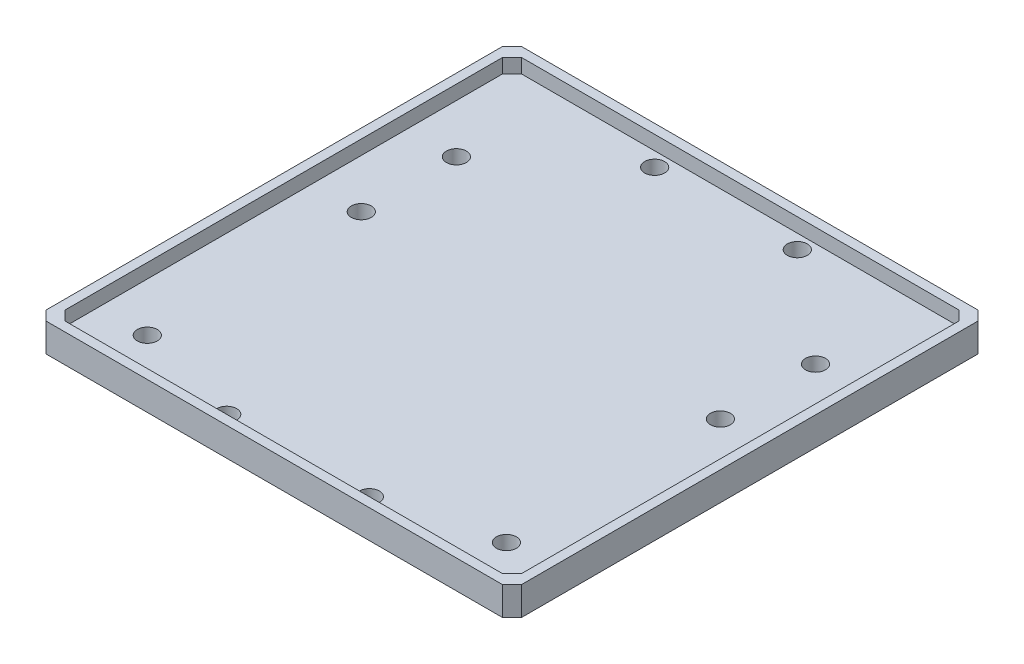
ISO-10303-21;
HEADER;
FILE_DESCRIPTION(('STEP AP214'),'2;1');
FILE_NAME('part.step','',(''),(''),'','','');
FILE_SCHEMA(('AUTOMOTIVE_DESIGN { 1 0 10303 214 1 1 1 1 }'));
ENDSEC;
DATA;
#1=APPLICATION_CONTEXT('core data for automotive mechanical design processes');
#2=APPLICATION_PROTOCOL_DEFINITION('international standard','automotive_design',2000,#1);
#3=PRODUCT_CONTEXT('',#1,'mechanical');
#4=PRODUCT('Part','Part','',(#3));
#5=PRODUCT_RELATED_PRODUCT_CATEGORY('part','',(#4));
#6=PRODUCT_DEFINITION_FORMATION('','',#4);
#7=PRODUCT_DEFINITION_CONTEXT('part definition',#1,'design');
#8=PRODUCT_DEFINITION('design','',#6,#7);
#9=PRODUCT_DEFINITION_SHAPE('','',#8);
#10=(LENGTH_UNIT() NAMED_UNIT(*) SI_UNIT(.MILLI.,.METRE.));
#11=(NAMED_UNIT(*) PLANE_ANGLE_UNIT() SI_UNIT($,.RADIAN.));
#12=(NAMED_UNIT(*) SI_UNIT($,.STERADIAN.) SOLID_ANGLE_UNIT());
#13=UNCERTAINTY_MEASURE_WITH_UNIT(LENGTH_MEASURE(1.E-05),#10,'distance_accuracy_value','');
#14=(GEOMETRIC_REPRESENTATION_CONTEXT(3) GLOBAL_UNCERTAINTY_ASSIGNED_CONTEXT((#13)) GLOBAL_UNIT_ASSIGNED_CONTEXT((#10,
#11,#12)) REPRESENTATION_CONTEXT('',''));
#15=CARTESIAN_POINT('',(0.,0.,0.));
#16=DIRECTION('',(0.,0.,1.));
#17=DIRECTION('',(1.,0.,0.));
#18=AXIS2_PLACEMENT_3D('',#15,#16,#17);
#19=CARTESIAN_POINT('',(0.,3.,0.));
#20=DIRECTION('',(0.,1.,0.));
#21=DIRECTION('',(0.,0.,1.));
#22=AXIS2_PLACEMENT_3D('',#19,#20,#21);
#23=PLANE('',#22);
#24=CARTESIAN_POINT('',(77.2035074999913,3.,87.3604147454228));
#25=DIRECTION('',(0.,1.,0.));
#26=DIRECTION('',(0.,0.,-1.));
#27=AXIS2_PLACEMENT_3D('',#24,#25,#26);
#28=CIRCLE('',#27,2.09999999999997);
#29=CARTESIAN_POINT('',(77.2035074999913,3.,85.2604147454228));
#30=VERTEX_POINT('',#29);
#31=EDGE_CURVE('E201',#30,#30,#28,.T.);
#32=ORIENTED_EDGE('',*,*,#31,.F.);
#33=EDGE_LOOP('',(#32));
#34=FACE_BOUND('',#33,.T.);
#35=CARTESIAN_POINT('',(77.2035074999913,3.,152.360414745423));
#36=DIRECTION('',(0.,1.,0.));
#37=DIRECTION('',(0.,0.,-1.));
#38=AXIS2_PLACEMENT_3D('',#35,#36,#37);
#39=CIRCLE('',#38,2.09999999999999);
#40=CARTESIAN_POINT('',(77.2035074999913,3.,150.260414745423));
#41=VERTEX_POINT('',#40);
#42=EDGE_CURVE('E213',#41,#41,#39,.T.);
#43=ORIENTED_EDGE('',*,*,#42,.F.);
#44=EDGE_LOOP('',(#43));
#45=FACE_BOUND('',#44,.T.);
#46=CARTESIAN_POINT('',(24.4441539849667,3.,68.4248216350618));
#47=DIRECTION('',(0.,1.,0.));
#48=DIRECTION('',(0.,0.,1.));
#49=AXIS2_PLACEMENT_3D('',#46,#47,#48);
#50=CIRCLE('',#49,2.1);
#51=CARTESIAN_POINT('',(24.4441539849667,3.,70.5248216350618));
#52=VERTEX_POINT('',#51);
#53=EDGE_CURVE('E225',#52,#52,#50,.T.);
#54=ORIENTED_EDGE('',*,*,#53,.F.);
#55=EDGE_LOOP('',(#54));
#56=FACE_BOUND('',#55,.T.);
#57=CARTESIAN_POINT('',(1.68480046994186,3.,152.360414745423));
#58=DIRECTION('',(0.,1.,0.));
#59=DIRECTION('',(0.,0.,1.));
#60=AXIS2_PLACEMENT_3D('',#57,#58,#59);
#61=CIRCLE('',#60,2.1);
#62=CARTESIAN_POINT('',(1.68480046994186,3.,154.460414745423));
#63=VERTEX_POINT('',#62);
#64=EDGE_CURVE('E237',#63,#63,#61,.T.);
#65=ORIENTED_EDGE('',*,*,#64,.F.);
#66=EDGE_LOOP('',(#65));
#67=FACE_BOUND('',#66,.T.);
#68=CARTESIAN_POINT('',(1.68480046994187,3.,87.3604147454228));
#69=DIRECTION('',(0.,1.,0.));
#70=DIRECTION('',(0.,0.,1.));
#71=AXIS2_PLACEMENT_3D('',#68,#69,#70);
#72=CIRCLE('',#71,2.09999999999998);
#73=CARTESIAN_POINT('',(1.68480046994187,3.,89.4604147454228));
#74=VERTEX_POINT('',#73);
#75=EDGE_CURVE('E249',#74,#74,#72,.T.);
#76=ORIENTED_EDGE('',*,*,#75,.F.);
#77=EDGE_LOOP('',(#76));
#78=FACE_BOUND('',#77,.T.);
#79=CARTESIAN_POINT('',(1.68480046994187,3.,107.360414745423));
#80=DIRECTION('',(0.,1.,0.));
#81=DIRECTION('',(0.,0.,1.));
#82=AXIS2_PLACEMENT_3D('',#79,#80,#81);
#83=CIRCLE('',#82,2.10000000000001);
#84=CARTESIAN_POINT('',(1.68480046994187,3.,109.460414745423));
#85=VERTEX_POINT('',#84);
#86=EDGE_CURVE('E243',#85,#85,#83,.T.);
#87=ORIENTED_EDGE('',*,*,#86,.F.);
#88=EDGE_LOOP('',(#87));
#89=FACE_BOUND('',#88,.T.);
#90=CARTESIAN_POINT('',(24.4441539849667,3.,158.424821635062));
#91=DIRECTION('',(0.,1.,0.));
#92=DIRECTION('',(0.,0.,1.));
#93=AXIS2_PLACEMENT_3D('',#90,#91,#92);
#94=CIRCLE('',#93,2.09999999999999);
#95=CARTESIAN_POINT('',(24.4441539849667,3.,160.524821635062));
#96=VERTEX_POINT('',#95);
#97=EDGE_CURVE('E231',#96,#96,#94,.T.);
#98=ORIENTED_EDGE('',*,*,#97,.F.);
#99=EDGE_LOOP('',(#98));
#100=FACE_BOUND('',#99,.T.);
#101=CARTESIAN_POINT('',(54.4441539849665,3.,158.424821635062));
#102=DIRECTION('',(0.,1.,0.));
#103=DIRECTION('',(0.,0.,-1.));
#104=AXIS2_PLACEMENT_3D('',#101,#102,#103);
#105=CIRCLE('',#104,2.09999999999999);
#106=CARTESIAN_POINT('',(54.4441539849665,3.,156.324821635062));
#107=VERTEX_POINT('',#106);
#108=EDGE_CURVE('E219',#107,#107,#105,.T.);
#109=ORIENTED_EDGE('',*,*,#108,.F.);
#110=EDGE_LOOP('',(#109));
#111=FACE_BOUND('',#110,.T.);
#112=CARTESIAN_POINT('',(77.2035074999913,3.,107.360414745423));
#113=DIRECTION('',(0.,1.,0.));
#114=DIRECTION('',(0.,0.,-1.));
#115=AXIS2_PLACEMENT_3D('',#112,#113,#114);
#116=CIRCLE('',#115,2.10000000000002);
#117=CARTESIAN_POINT('',(77.2035074999913,3.,105.260414745423));
#118=VERTEX_POINT('',#117);
#119=EDGE_CURVE('E207',#118,#118,#116,.T.);
#120=ORIENTED_EDGE('',*,*,#119,.F.);
#121=EDGE_LOOP('',(#120));
#122=FACE_BOUND('',#121,.T.);
#123=CARTESIAN_POINT('',(54.4441539849665,3.,68.4248216350618));
#124=DIRECTION('',(0.,1.,0.));
#125=DIRECTION('',(0.,0.,-1.));
#126=AXIS2_PLACEMENT_3D('',#123,#124,#125);
#127=CIRCLE('',#126,2.1);
#128=CARTESIAN_POINT('',(54.4441539849665,3.,66.3248216350618));
#129=VERTEX_POINT('',#128);
#130=EDGE_CURVE('E193',#129,#129,#127,.T.);
#131=ORIENTED_EDGE('',*,*,#130,.F.);
#132=EDGE_LOOP('',(#131));
#133=FACE_BOUND('',#132,.T.);
#134=DIRECTION('',(0.,0.,-1.));
#135=VECTOR('',#134,1.);
#136=CARTESIAN_POINT('',(-8.55584601503339,3.,163.424821635062));
#137=LINE('',#136,#135);
#138=CARTESIAN_POINT('',(-8.55584601503339,3.,159.424821635062));
#139=VERTEX_POINT('',#138);
#140=CARTESIAN_POINT('',(-8.55584601503339,3.,67.4248216350618));
#141=VERTEX_POINT('',#140);
#142=EDGE_CURVE('E180',#139,#141,#137,.T.);
#143=ORIENTED_EDGE('',*,*,#142,.F.);
#144=DIRECTION('',(-0.707106781186547,0.,-0.707106781186548));
#145=VECTOR('',#144,1.);
#146=CARTESIAN_POINT('',(-6.55584601503339,3.,161.424821635062));
#147=LINE('',#146,#145);
#148=CARTESIAN_POINT('',(-6.55584601503339,3.,161.424821635062));
#149=VERTEX_POINT('',#148);
#150=EDGE_CURVE('E165',#149,#139,#147,.T.);
#151=ORIENTED_EDGE('',*,*,#150,.F.);
#152=DIRECTION('',(-1.,0.,0.));
#153=VECTOR('',#152,1.);
#154=CARTESIAN_POINT('',(-8.55584601503339,3.,161.424821635062));
#155=LINE('',#154,#153);
#156=CARTESIAN_POINT('',(85.4441539849666,3.,161.424821635062));
#157=VERTEX_POINT('',#156);
#158=EDGE_CURVE('E483',#157,#149,#155,.T.);
#159=ORIENTED_EDGE('',*,*,#158,.F.);
#160=DIRECTION('',(-0.707106781186545,0.,0.70710678118655));
#161=VECTOR('',#160,1.);
#162=CARTESIAN_POINT('',(85.4441539849666,3.,161.424821635062));
#163=LINE('',#162,#161);
#164=CARTESIAN_POINT('',(87.4441539849666,3.,159.424821635062));
#165=VERTEX_POINT('',#164);
#166=EDGE_CURVE('E173',#165,#157,#163,.T.);
#167=ORIENTED_EDGE('',*,*,#166,.F.);
#168=DIRECTION('',(0.,0.,-1.));
#169=VECTOR('',#168,1.);
#170=CARTESIAN_POINT('',(87.4441539849667,3.,0.));
#171=LINE('',#170,#169);
#172=CARTESIAN_POINT('',(87.4441539849666,3.,67.4248216350618));
#173=VERTEX_POINT('',#172);
#174=EDGE_CURVE('E187',#165,#173,#171,.T.);
#175=ORIENTED_EDGE('',*,*,#174,.T.);
#176=DIRECTION('',(0.707106781186545,0.,0.70710678118655));
#177=VECTOR('',#176,1.);
#178=CARTESIAN_POINT('',(85.4441539849666,3.,65.4248216350618));
#179=LINE('',#178,#177);
#180=CARTESIAN_POINT('',(85.4441539849666,3.,65.4248216350618));
#181=VERTEX_POINT('',#180);
#182=EDGE_CURVE('E500',#181,#173,#179,.T.);
#183=ORIENTED_EDGE('',*,*,#182,.F.);
#184=DIRECTION('',(1.,0.,0.));
#185=VECTOR('',#184,1.);
#186=CARTESIAN_POINT('',(0.,3.,65.4248216350618));
#187=LINE('',#186,#185);
#188=CARTESIAN_POINT('',(-6.55584601503339,3.,65.4248216350618));
#189=VERTEX_POINT('',#188);
#190=EDGE_CURVE('E191',#189,#181,#187,.T.);
#191=ORIENTED_EDGE('',*,*,#190,.F.);
#192=DIRECTION('',(0.707106781186547,0.,-0.707106781186548));
#193=VECTOR('',#192,1.);
#194=CARTESIAN_POINT('',(-6.55584601503339,3.,65.4248216350618));
#195=LINE('',#194,#193);
#196=EDGE_CURVE('E481',#141,#189,#195,.T.);
#197=ORIENTED_EDGE('',*,*,#196,.F.);
#198=EDGE_LOOP('',(#143,#151,#159,#167,#175,#183,#191,#197));
#199=FACE_BOUND('',#198,.T.);
#200=ADVANCED_FACE('F40',(#34,#45,#56,#67,#78,#89,#100,#111,#122,#133,#199),#23,.T.);
#201=CARTESIAN_POINT('',(-8.55584601503339,6.,161.424821635062));
#202=DIRECTION('',(0.,0.,1.));
#203=DIRECTION('',(1.,0.,0.));
#204=AXIS2_PLACEMENT_3D('',#201,#202,#203);
#205=PLANE('',#204);
#206=DIRECTION('',(0.,-1.,0.));
#207=VECTOR('',#206,1.);
#208=CARTESIAN_POINT('',(-6.55584601503339,6.,161.424821635062));
#209=LINE('',#208,#207);
#210=CARTESIAN_POINT('',(-6.55584601503339,6.,161.424821635062));
#211=VERTEX_POINT('',#210);
#212=EDGE_CURVE('E164',#211,#149,#209,.T.);
#213=ORIENTED_EDGE('',*,*,#212,.F.);
#214=DIRECTION('',(-1.,0.,0.));
#215=VECTOR('',#214,1.);
#216=CARTESIAN_POINT('',(-8.55584601503339,6.,161.424821635062));
#217=LINE('',#216,#215);
#218=CARTESIAN_POINT('',(85.4441539849666,6.,161.424821635062));
#219=VERTEX_POINT('',#218);
#220=EDGE_CURVE('E161',#219,#211,#217,.T.);
#221=ORIENTED_EDGE('',*,*,#220,.F.);
#222=DIRECTION('',(0.,-1.,0.));
#223=VECTOR('',#222,1.);
#224=CARTESIAN_POINT('',(85.4441539849666,6.,161.424821635062));
#225=LINE('',#224,#223);
#226=EDGE_CURVE('E56',#219,#157,#225,.T.);
#227=ORIENTED_EDGE('',*,*,#226,.T.);
#228=ORIENTED_EDGE('',*,*,#158,.T.);
#229=EDGE_LOOP('',(#213,#221,#227,#228));
#230=FACE_BOUND('',#229,.T.);
#231=ADVANCED_FACE('F348',(#230),#205,.F.);
#232=CARTESIAN_POINT('',(-8.55584601503339,6.,163.424821635062));
#233=DIRECTION('',(-1.,0.,0.));
#234=DIRECTION('',(0.,0.,1.));
#235=AXIS2_PLACEMENT_3D('',#232,#233,#234);
#236=PLANE('',#235);
#237=DIRECTION('',(0.,-1.,0.));
#238=VECTOR('',#237,1.);
#239=CARTESIAN_POINT('',(-8.55584601503339,6.,159.424821635062));
#240=LINE('',#239,#238);
#241=CARTESIAN_POINT('',(-8.55584601503339,6.,159.424821635062));
#242=VERTEX_POINT('',#241);
#243=EDGE_CURVE('E168',#242,#139,#240,.T.);
#244=ORIENTED_EDGE('',*,*,#243,.T.);
#245=ORIENTED_EDGE('',*,*,#142,.T.);
#246=DIRECTION('',(0.,-1.,0.));
#247=VECTOR('',#246,1.);
#248=CARTESIAN_POINT('',(-8.55584601503339,6.,67.4248216350618));
#249=LINE('',#248,#247);
#250=CARTESIAN_POINT('',(-8.55584601503339,6.,67.4248216350618));
#251=VERTEX_POINT('',#250);
#252=EDGE_CURVE('E178',#251,#141,#249,.T.);
#253=ORIENTED_EDGE('',*,*,#252,.F.);
#254=DIRECTION('',(0.,0.,-1.));
#255=VECTOR('',#254,1.);
#256=CARTESIAN_POINT('',(-8.55584601503339,6.,163.424821635062));
#257=LINE('',#256,#255);
#258=EDGE_CURVE('E159',#242,#251,#257,.T.);
#259=ORIENTED_EDGE('',*,*,#258,.F.);
#260=EDGE_LOOP('',(#244,#245,#253,#259));
#261=FACE_BOUND('',#260,.T.);
#262=ADVANCED_FACE('F176',(#261),#236,.F.);
#263=CARTESIAN_POINT('',(87.4441539849667,6.,0.));
#264=DIRECTION('',(-1.,0.,0.));
#265=DIRECTION('',(0.,0.,1.));
#266=AXIS2_PLACEMENT_3D('',#263,#264,#265);
#267=PLANE('',#266);
#268=ORIENTED_EDGE('',*,*,#174,.F.);
#269=DIRECTION('',(0.,-1.,0.));
#270=VECTOR('',#269,1.);
#271=CARTESIAN_POINT('',(87.4441539849666,6.,159.424821635062));
#272=LINE('',#271,#270);
#273=CARTESIAN_POINT('',(87.4441539849666,6.,159.424821635062));
#274=VERTEX_POINT('',#273);
#275=EDGE_CURVE('E509',#274,#165,#272,.T.);
#276=ORIENTED_EDGE('',*,*,#275,.F.);
#277=DIRECTION('',(0.,0.,-1.));
#278=VECTOR('',#277,1.);
#279=CARTESIAN_POINT('',(87.4441539849667,6.,0.));
#280=LINE('',#279,#278);
#281=CARTESIAN_POINT('',(87.4441539849666,6.,67.4248216350618));
#282=VERTEX_POINT('',#281);
#283=EDGE_CURVE('E308',#274,#282,#280,.T.);
#284=ORIENTED_EDGE('',*,*,#283,.T.);
#285=DIRECTION('',(0.,-1.,0.));
#286=VECTOR('',#285,1.);
#287=CARTESIAN_POINT('',(87.4441539849666,6.,67.4248216350618));
#288=LINE('',#287,#286);
#289=EDGE_CURVE('E506',#282,#173,#288,.T.);
#290=ORIENTED_EDGE('',*,*,#289,.T.);
#291=EDGE_LOOP('',(#268,#276,#284,#290));
#292=FACE_BOUND('',#291,.T.);
#293=ADVANCED_FACE('F397',(#292),#267,.T.);
#294=CARTESIAN_POINT('',(0.,6.,65.4248216350618));
#295=DIRECTION('',(0.,0.,-1.));
#296=DIRECTION('',(-1.,0.,0.));
#297=AXIS2_PLACEMENT_3D('',#294,#295,#296);
#298=PLANE('',#297);
#299=DIRECTION('',(0.,-1.,0.));
#300=VECTOR('',#299,1.);
#301=CARTESIAN_POINT('',(85.4441539849666,6.,65.4248216350618));
#302=LINE('',#301,#300);
#303=CARTESIAN_POINT('',(85.4441539849666,6.,65.4248216350618));
#304=VERTEX_POINT('',#303);
#305=EDGE_CURVE('E507',#304,#181,#302,.T.);
#306=ORIENTED_EDGE('',*,*,#305,.F.);
#307=DIRECTION('',(1.,0.,0.));
#308=VECTOR('',#307,1.);
#309=CARTESIAN_POINT('',(0.,6.,65.4248216350618));
#310=LINE('',#309,#308);
#311=CARTESIAN_POINT('',(-6.55584601503339,6.,65.4248216350618));
#312=VERTEX_POINT('',#311);
#313=EDGE_CURVE('E491',#312,#304,#310,.T.);
#314=ORIENTED_EDGE('',*,*,#313,.F.);
#315=DIRECTION('',(0.,-1.,0.));
#316=VECTOR('',#315,1.);
#317=CARTESIAN_POINT('',(-6.55584601503339,6.,65.4248216350618));
#318=LINE('',#317,#316);
#319=EDGE_CURVE('E64',#312,#189,#318,.T.);
#320=ORIENTED_EDGE('',*,*,#319,.T.);
#321=ORIENTED_EDGE('',*,*,#190,.T.);
#322=EDGE_LOOP('',(#306,#314,#320,#321));
#323=FACE_BOUND('',#322,.T.);
#324=ADVANCED_FACE('F364',(#323),#298,.F.);
#325=CARTESIAN_POINT('',(0.,0.,0.));
#326=DIRECTION('',(0.,1.,0.));
#327=DIRECTION('',(0.,0.,1.));
#328=AXIS2_PLACEMENT_3D('',#325,#326,#327);
#329=PLANE('',#328);
#330=DIRECTION('',(0.,0.,1.));
#331=VECTOR('',#330,1.);
#332=CARTESIAN_POINT('',(-10.5558460150334,0.,63.4248216350618));
#333=LINE('',#332,#331);
#334=CARTESIAN_POINT('',(-10.5558460150334,0.,65.4248216350618));
#335=VERTEX_POINT('',#334);
#336=CARTESIAN_POINT('',(-10.5558460150334,0.,161.424821635062));
#337=VERTEX_POINT('',#336);
#338=EDGE_CURVE('E252',#335,#337,#333,.T.);
#339=ORIENTED_EDGE('',*,*,#338,.F.);
#340=DIRECTION('',(-0.70710678118655,0.,0.707106781186545));
#341=VECTOR('',#340,1.);
#342=CARTESIAN_POINT('',(-10.5558460150334,0.,65.4248216350618));
#343=LINE('',#342,#341);
#344=CARTESIAN_POINT('',(-8.55584601503337,0.,63.4248216350618));
#345=VERTEX_POINT('',#344);
#346=EDGE_CURVE('E277',#335,#345,#343,.F.);
#347=ORIENTED_EDGE('',*,*,#346,.T.);
#348=DIRECTION('',(-1.,0.,0.));
#349=VECTOR('',#348,1.);
#350=CARTESIAN_POINT('',(-10.5558460150334,0.,63.4248216350618));
#351=LINE('',#350,#349);
#352=CARTESIAN_POINT('',(87.4441539849666,0.,63.4248216350618));
#353=VERTEX_POINT('',#352);
#354=EDGE_CURVE('E263',#353,#345,#351,.T.);
#355=ORIENTED_EDGE('',*,*,#354,.F.);
#356=DIRECTION('',(-0.707106781186545,0.,-0.70710678118655));
#357=VECTOR('',#356,1.);
#358=CARTESIAN_POINT('',(87.4441539849666,0.,63.4248216350618));
#359=LINE('',#358,#357);
#360=CARTESIAN_POINT('',(89.4441539849666,0.,65.4248216350618));
#361=VERTEX_POINT('',#360);
#362=EDGE_CURVE('E271',#353,#361,#359,.F.);
#363=ORIENTED_EDGE('',*,*,#362,.T.);
#364=DIRECTION('',(0.,0.,-1.));
#365=VECTOR('',#364,1.);
#366=CARTESIAN_POINT('',(89.4441539849666,0.,63.4248216350618));
#367=LINE('',#366,#365);
#368=CARTESIAN_POINT('',(89.4441539849666,0.,161.424821635062));
#369=VERTEX_POINT('',#368);
#370=EDGE_CURVE('E260',#369,#361,#367,.T.);
#371=ORIENTED_EDGE('',*,*,#370,.F.);
#372=DIRECTION('',(0.70710678118655,0.,-0.707106781186545));
#373=VECTOR('',#372,1.);
#374=CARTESIAN_POINT('',(89.4441539849666,0.,161.424821635062));
#375=LINE('',#374,#373);
#376=CARTESIAN_POINT('',(87.4441539849666,0.,163.424821635062));
#377=VERTEX_POINT('',#376);
#378=EDGE_CURVE('E273',#369,#377,#375,.F.);
#379=ORIENTED_EDGE('',*,*,#378,.T.);
#380=DIRECTION('',(1.,0.,0.));
#381=VECTOR('',#380,1.);
#382=CARTESIAN_POINT('',(-10.5558460150334,0.,163.424821635062));
#383=LINE('',#382,#381);
#384=CARTESIAN_POINT('',(-8.55584601503338,0.,163.424821635062));
#385=VERTEX_POINT('',#384);
#386=EDGE_CURVE('E257',#385,#377,#383,.T.);
#387=ORIENTED_EDGE('',*,*,#386,.F.);
#388=DIRECTION('',(0.707106781186543,0.,0.707106781186552));
#389=VECTOR('',#388,1.);
#390=CARTESIAN_POINT('',(-8.55584601503338,0.,163.424821635062));
#391=LINE('',#390,#389);
#392=EDGE_CURVE('E275',#385,#337,#391,.F.);
#393=ORIENTED_EDGE('',*,*,#392,.T.);
#394=EDGE_LOOP('',(#339,#347,#355,#363,#371,#379,#387,#393));
#395=FACE_BOUND('',#394,.T.);
#396=CARTESIAN_POINT('',(1.68480046994187,0.,87.3604147454228));
#397=DIRECTION('',(0.,1.,0.));
#398=DIRECTION('',(0.,0.,1.));
#399=AXIS2_PLACEMENT_3D('',#396,#397,#398);
#400=CIRCLE('',#399,2.09999999999998);
#401=CARTESIAN_POINT('',(1.68480046994187,0.,89.4604147454228));
#402=VERTEX_POINT('',#401);
#403=EDGE_CURVE('E246',#402,#402,#400,.T.);
#404=ORIENTED_EDGE('',*,*,#403,.T.);
#405=EDGE_LOOP('',(#404));
#406=FACE_BOUND('',#405,.T.);
#407=CARTESIAN_POINT('',(1.68480046994187,0.,107.360414745423));
#408=DIRECTION('',(0.,1.,0.));
#409=DIRECTION('',(0.,0.,1.));
#410=AXIS2_PLACEMENT_3D('',#407,#408,#409);
#411=CIRCLE('',#410,2.10000000000001);
#412=CARTESIAN_POINT('',(1.68480046994187,0.,109.460414745423));
#413=VERTEX_POINT('',#412);
#414=EDGE_CURVE('E240',#413,#413,#411,.T.);
#415=ORIENTED_EDGE('',*,*,#414,.T.);
#416=EDGE_LOOP('',(#415));
#417=FACE_BOUND('',#416,.T.);
#418=CARTESIAN_POINT('',(1.68480046994186,0.,152.360414745423));
#419=DIRECTION('',(0.,1.,0.));
#420=DIRECTION('',(0.,0.,1.));
#421=AXIS2_PLACEMENT_3D('',#418,#419,#420);
#422=CIRCLE('',#421,2.1);
#423=CARTESIAN_POINT('',(1.68480046994186,0.,154.460414745423));
#424=VERTEX_POINT('',#423);
#425=EDGE_CURVE('E234',#424,#424,#422,.T.);
#426=ORIENTED_EDGE('',*,*,#425,.T.);
#427=EDGE_LOOP('',(#426));
#428=FACE_BOUND('',#427,.T.);
#429=CARTESIAN_POINT('',(24.4441539849667,0.,158.424821635062));
#430=DIRECTION('',(0.,1.,0.));
#431=DIRECTION('',(0.,0.,1.));
#432=AXIS2_PLACEMENT_3D('',#429,#430,#431);
#433=CIRCLE('',#432,2.09999999999999);
#434=CARTESIAN_POINT('',(24.4441539849667,0.,160.524821635062));
#435=VERTEX_POINT('',#434);
#436=EDGE_CURVE('E228',#435,#435,#433,.T.);
#437=ORIENTED_EDGE('',*,*,#436,.T.);
#438=EDGE_LOOP('',(#437));
#439=FACE_BOUND('',#438,.T.);
#440=CARTESIAN_POINT('',(24.4441539849667,0.,68.4248216350618));
#441=DIRECTION('',(0.,1.,0.));
#442=DIRECTION('',(0.,0.,1.));
#443=AXIS2_PLACEMENT_3D('',#440,#441,#442);
#444=CIRCLE('',#443,2.1);
#445=CARTESIAN_POINT('',(24.4441539849667,0.,70.5248216350618));
#446=VERTEX_POINT('',#445);
#447=EDGE_CURVE('E222',#446,#446,#444,.T.);
#448=ORIENTED_EDGE('',*,*,#447,.T.);
#449=EDGE_LOOP('',(#448));
#450=FACE_BOUND('',#449,.T.);
#451=CARTESIAN_POINT('',(54.4441539849665,0.,158.424821635062));
#452=DIRECTION('',(0.,1.,0.));
#453=DIRECTION('',(0.,0.,-1.));
#454=AXIS2_PLACEMENT_3D('',#451,#452,#453);
#455=CIRCLE('',#454,2.09999999999999);
#456=CARTESIAN_POINT('',(54.4441539849665,0.,156.324821635062));
#457=VERTEX_POINT('',#456);
#458=EDGE_CURVE('E216',#457,#457,#455,.T.);
#459=ORIENTED_EDGE('',*,*,#458,.T.);
#460=EDGE_LOOP('',(#459));
#461=FACE_BOUND('',#460,.T.);
#462=CARTESIAN_POINT('',(77.2035074999913,0.,152.360414745423));
#463=DIRECTION('',(0.,1.,0.));
#464=DIRECTION('',(0.,0.,-1.));
#465=AXIS2_PLACEMENT_3D('',#462,#463,#464);
#466=CIRCLE('',#465,2.09999999999999);
#467=CARTESIAN_POINT('',(77.2035074999913,0.,150.260414745423));
#468=VERTEX_POINT('',#467);
#469=EDGE_CURVE('E210',#468,#468,#466,.T.);
#470=ORIENTED_EDGE('',*,*,#469,.T.);
#471=EDGE_LOOP('',(#470));
#472=FACE_BOUND('',#471,.T.);
#473=CARTESIAN_POINT('',(77.2035074999913,0.,107.360414745423));
#474=DIRECTION('',(0.,1.,0.));
#475=DIRECTION('',(0.,0.,-1.));
#476=AXIS2_PLACEMENT_3D('',#473,#474,#475);
#477=CIRCLE('',#476,2.10000000000002);
#478=CARTESIAN_POINT('',(77.2035074999913,0.,105.260414745423));
#479=VERTEX_POINT('',#478);
#480=EDGE_CURVE('E204',#479,#479,#477,.T.);
#481=ORIENTED_EDGE('',*,*,#480,.T.);
#482=EDGE_LOOP('',(#481));
#483=FACE_BOUND('',#482,.T.);
#484=CARTESIAN_POINT('',(77.2035074999913,0.,87.3604147454228));
#485=DIRECTION('',(0.,1.,0.));
#486=DIRECTION('',(0.,0.,-1.));
#487=AXIS2_PLACEMENT_3D('',#484,#485,#486);
#488=CIRCLE('',#487,2.09999999999997);
#489=CARTESIAN_POINT('',(77.2035074999913,0.,85.2604147454228));
#490=VERTEX_POINT('',#489);
#491=EDGE_CURVE('E196',#490,#490,#488,.T.);
#492=ORIENTED_EDGE('',*,*,#491,.T.);
#493=EDGE_LOOP('',(#492));
#494=FACE_BOUND('',#493,.T.);
#495=CARTESIAN_POINT('',(54.4441539849665,0.,68.4248216350618));
#496=DIRECTION('',(0.,1.,0.));
#497=DIRECTION('',(0.,0.,-1.));
#498=AXIS2_PLACEMENT_3D('',#495,#496,#497);
#499=CIRCLE('',#498,2.1);
#500=CARTESIAN_POINT('',(54.4441539849665,0.,66.3248216350618));
#501=VERTEX_POINT('',#500);
#502=EDGE_CURVE('E197',#501,#501,#499,.T.);
#503=ORIENTED_EDGE('',*,*,#502,.T.);
#504=EDGE_LOOP('',(#503));
#505=FACE_BOUND('',#504,.T.);
#506=ADVANCED_FACE('F318',(#395,#406,#417,#428,#439,#450,#461,#472,#483,#494,#505),#329,.F.);
#507=CARTESIAN_POINT('',(-10.5558460150334,3.,63.4248216350618));
#508=DIRECTION('',(1.,0.,0.));
#509=DIRECTION('',(0.,0.,-1.));
#510=AXIS2_PLACEMENT_3D('',#507,#508,#509);
#511=PLANE('',#510);
#512=DIRECTION('',(0.,0.,-1.));
#513=VECTOR('',#512,1.);
#514=CARTESIAN_POINT('',(-10.5558460150334,6.,163.424821635062));
#515=LINE('',#514,#513);
#516=CARTESIAN_POINT('',(-10.5558460150334,6.,161.424821635062));
#517=VERTEX_POINT('',#516);
#518=CARTESIAN_POINT('',(-10.5558460150334,6.,65.4248216350618));
#519=VERTEX_POINT('',#518);
#520=EDGE_CURVE('E179',#517,#519,#515,.T.);
#521=ORIENTED_EDGE('',*,*,#520,.T.);
#522=DIRECTION('',(0.,-1.,0.));
#523=VECTOR('',#522,1.);
#524=CARTESIAN_POINT('',(-10.5558460150334,3.,65.4248216350618));
#525=LINE('',#524,#523);
#526=EDGE_CURVE('E268',#519,#335,#525,.T.);
#527=ORIENTED_EDGE('',*,*,#526,.T.);
#528=ORIENTED_EDGE('',*,*,#338,.T.);
#529=DIRECTION('',(0.,1.,0.));
#530=VECTOR('',#529,1.);
#531=CARTESIAN_POINT('',(-10.5558460150334,3.,161.424821635062));
#532=LINE('',#531,#530);
#533=EDGE_CURVE('E266',#337,#517,#532,.T.);
#534=ORIENTED_EDGE('',*,*,#533,.T.);
#535=EDGE_LOOP('',(#521,#527,#528,#534));
#536=FACE_BOUND('',#535,.T.);
#537=ADVANCED_FACE('F325',(#536),#511,.F.);
#538=CARTESIAN_POINT('',(-10.5558460150334,3.,163.424821635062));
#539=DIRECTION('',(0.,0.,-1.));
#540=DIRECTION('',(-1.,0.,0.));
#541=AXIS2_PLACEMENT_3D('',#538,#539,#540);
#542=PLANE('',#541);
#543=DIRECTION('',(1.,0.,0.));
#544=VECTOR('',#543,1.);
#545=CARTESIAN_POINT('',(-10.5558460150334,6.,163.424821635062));
#546=LINE('',#545,#544);
#547=CARTESIAN_POINT('',(-8.55584601503338,6.,163.424821635062));
#548=VERTEX_POINT('',#547);
#549=CARTESIAN_POINT('',(87.4441539849666,6.,163.424821635062));
#550=VERTEX_POINT('',#549);
#551=EDGE_CURVE('E183',#548,#550,#546,.T.);
#552=ORIENTED_EDGE('',*,*,#551,.F.);
#553=DIRECTION('',(0.,-1.,0.));
#554=VECTOR('',#553,1.);
#555=CARTESIAN_POINT('',(-8.55584601503338,3.,163.424821635062));
#556=LINE('',#555,#554);
#557=EDGE_CURVE('E294',#548,#385,#556,.T.);
#558=ORIENTED_EDGE('',*,*,#557,.T.);
#559=ORIENTED_EDGE('',*,*,#386,.T.);
#560=DIRECTION('',(0.,1.,0.));
#561=VECTOR('',#560,1.);
#562=CARTESIAN_POINT('',(87.4441539849666,3.,163.424821635062));
#563=LINE('',#562,#561);
#564=EDGE_CURVE('E292',#377,#550,#563,.T.);
#565=ORIENTED_EDGE('',*,*,#564,.T.);
#566=EDGE_LOOP('',(#552,#558,#559,#565));
#567=FACE_BOUND('',#566,.T.);
#568=ADVANCED_FACE('F335',(#567),#542,.F.);
#569=CARTESIAN_POINT('',(89.4441539849666,3.,63.4248216350618));
#570=DIRECTION('',(-1.,0.,0.));
#571=DIRECTION('',(0.,0.,1.));
#572=AXIS2_PLACEMENT_3D('',#569,#570,#571);
#573=PLANE('',#572);
#574=DIRECTION('',(0.,0.,-1.));
#575=VECTOR('',#574,1.);
#576=CARTESIAN_POINT('',(89.4441539849666,6.,0.));
#577=LINE('',#576,#575);
#578=CARTESIAN_POINT('',(89.4441539849666,6.,161.424821635062));
#579=VERTEX_POINT('',#578);
#580=CARTESIAN_POINT('',(89.4441539849666,6.,65.4248216350618));
#581=VERTEX_POINT('',#580);
#582=EDGE_CURVE('E200',#579,#581,#577,.T.);
#583=ORIENTED_EDGE('',*,*,#582,.F.);
#584=DIRECTION('',(0.,-1.,0.));
#585=VECTOR('',#584,1.);
#586=CARTESIAN_POINT('',(89.4441539849666,3.,161.424821635062));
#587=LINE('',#586,#585);
#588=EDGE_CURVE('E11',#579,#369,#587,.T.);
#589=ORIENTED_EDGE('',*,*,#588,.T.);
#590=ORIENTED_EDGE('',*,*,#370,.T.);
#591=DIRECTION('',(0.,1.,0.));
#592=VECTOR('',#591,1.);
#593=CARTESIAN_POINT('',(89.4441539849666,3.,65.4248216350618));
#594=LINE('',#593,#592);
#595=EDGE_CURVE('E49',#361,#581,#594,.T.);
#596=ORIENTED_EDGE('',*,*,#595,.T.);
#597=EDGE_LOOP('',(#583,#589,#590,#596));
#598=FACE_BOUND('',#597,.T.);
#599=ADVANCED_FACE('F300',(#598),#573,.F.);
#600=CARTESIAN_POINT('',(-10.5558460150334,3.,63.4248216350618));
#601=DIRECTION('',(0.,0.,1.));
#602=DIRECTION('',(1.,0.,0.));
#603=AXIS2_PLACEMENT_3D('',#600,#601,#602);
#604=PLANE('',#603);
#605=ORIENTED_EDGE('',*,*,#354,.T.);
#606=DIRECTION('',(0.,1.,0.));
#607=VECTOR('',#606,1.);
#608=CARTESIAN_POINT('',(-8.55584601503337,3.,63.4248216350618));
#609=LINE('',#608,#607);
#610=CARTESIAN_POINT('',(-8.55584601503337,6.,63.4248216350618));
#611=VERTEX_POINT('',#610);
#612=EDGE_CURVE('E282',#345,#611,#609,.T.);
#613=ORIENTED_EDGE('',*,*,#612,.T.);
#614=DIRECTION('',(-1.,0.,0.));
#615=VECTOR('',#614,1.);
#616=CARTESIAN_POINT('',(0.,6.,63.4248216350618));
#617=LINE('',#616,#615);
#618=CARTESIAN_POINT('',(87.4441539849666,6.,63.4248216350618));
#619=VERTEX_POINT('',#618);
#620=EDGE_CURVE('E315',#619,#611,#617,.T.);
#621=ORIENTED_EDGE('',*,*,#620,.F.);
#622=DIRECTION('',(0.,-1.,0.));
#623=VECTOR('',#622,1.);
#624=CARTESIAN_POINT('',(87.4441539849666,3.,63.4248216350618));
#625=LINE('',#624,#623);
#626=EDGE_CURVE('E279',#619,#353,#625,.T.);
#627=ORIENTED_EDGE('',*,*,#626,.T.);
#628=EDGE_LOOP('',(#605,#613,#621,#627));
#629=FACE_BOUND('',#628,.T.);
#630=ADVANCED_FACE('F313',(#629),#604,.F.);
#631=CARTESIAN_POINT('',(1.68480046994187,3.,87.3604147454228));
#632=DIRECTION('',(0.,-1.,0.));
#633=DIRECTION('',(0.,0.,-1.));
#634=AXIS2_PLACEMENT_3D('',#631,#632,#633);
#635=CYLINDRICAL_SURFACE('',#634,2.09999999999998);
#636=ORIENTED_EDGE('',*,*,#75,.T.);
#637=EDGE_LOOP('',(#636));
#638=FACE_BOUND('',#637,.T.);
#639=ORIENTED_EDGE('',*,*,#403,.F.);
#640=EDGE_LOOP('',(#639));
#641=FACE_BOUND('',#640,.T.);
#642=ADVANCED_FACE('F360',(#638,#641),#635,.F.);
#643=CARTESIAN_POINT('',(1.68480046994187,3.,107.360414745423));
#644=DIRECTION('',(0.,-1.,0.));
#645=DIRECTION('',(0.,0.,-1.));
#646=AXIS2_PLACEMENT_3D('',#643,#644,#645);
#647=CYLINDRICAL_SURFACE('',#646,2.10000000000001);
#648=ORIENTED_EDGE('',*,*,#86,.T.);
#649=EDGE_LOOP('',(#648));
#650=FACE_BOUND('',#649,.T.);
#651=ORIENTED_EDGE('',*,*,#414,.F.);
#652=EDGE_LOOP('',(#651));
#653=FACE_BOUND('',#652,.T.);
#654=ADVANCED_FACE('F431',(#650,#653),#647,.F.);
#655=CARTESIAN_POINT('',(1.68480046994186,3.,152.360414745423));
#656=DIRECTION('',(0.,-1.,0.));
#657=DIRECTION('',(0.,0.,-1.));
#658=AXIS2_PLACEMENT_3D('',#655,#656,#657);
#659=CYLINDRICAL_SURFACE('',#658,2.1);
#660=ORIENTED_EDGE('',*,*,#64,.T.);
#661=EDGE_LOOP('',(#660));
#662=FACE_BOUND('',#661,.T.);
#663=ORIENTED_EDGE('',*,*,#425,.F.);
#664=EDGE_LOOP('',(#663));
#665=FACE_BOUND('',#664,.T.);
#666=ADVANCED_FACE('F428',(#662,#665),#659,.F.);
#667=CARTESIAN_POINT('',(24.4441539849667,3.,158.424821635062));
#668=DIRECTION('',(0.,-1.,0.));
#669=DIRECTION('',(0.,0.,-1.));
#670=AXIS2_PLACEMENT_3D('',#667,#668,#669);
#671=CYLINDRICAL_SURFACE('',#670,2.09999999999999);
#672=ORIENTED_EDGE('',*,*,#97,.T.);
#673=EDGE_LOOP('',(#672));
#674=FACE_BOUND('',#673,.T.);
#675=ORIENTED_EDGE('',*,*,#436,.F.);
#676=EDGE_LOOP('',(#675));
#677=FACE_BOUND('',#676,.T.);
#678=ADVANCED_FACE('F424',(#674,#677),#671,.F.);
#679=CARTESIAN_POINT('',(24.4441539849667,3.,68.4248216350618));
#680=DIRECTION('',(0.,-1.,0.));
#681=DIRECTION('',(0.,0.,-1.));
#682=AXIS2_PLACEMENT_3D('',#679,#680,#681);
#683=CYLINDRICAL_SURFACE('',#682,2.1);
#684=ORIENTED_EDGE('',*,*,#53,.T.);
#685=EDGE_LOOP('',(#684));
#686=FACE_BOUND('',#685,.T.);
#687=ORIENTED_EDGE('',*,*,#447,.F.);
#688=EDGE_LOOP('',(#687));
#689=FACE_BOUND('',#688,.T.);
#690=ADVANCED_FACE('F420',(#686,#689),#683,.F.);
#691=CARTESIAN_POINT('',(54.4441539849665,3.,158.424821635062));
#692=DIRECTION('',(0.,-1.,0.));
#693=DIRECTION('',(0.,0.,-1.));
#694=AXIS2_PLACEMENT_3D('',#691,#692,#693);
#695=CYLINDRICAL_SURFACE('',#694,2.09999999999999);
#696=ORIENTED_EDGE('',*,*,#108,.T.);
#697=EDGE_LOOP('',(#696));
#698=FACE_BOUND('',#697,.T.);
#699=ORIENTED_EDGE('',*,*,#458,.F.);
#700=EDGE_LOOP('',(#699));
#701=FACE_BOUND('',#700,.T.);
#702=ADVANCED_FACE('F416',(#698,#701),#695,.F.);
#703=CARTESIAN_POINT('',(77.2035074999913,3.,152.360414745423));
#704=DIRECTION('',(0.,-1.,0.));
#705=DIRECTION('',(0.,0.,-1.));
#706=AXIS2_PLACEMENT_3D('',#703,#704,#705);
#707=CYLINDRICAL_SURFACE('',#706,2.09999999999999);
#708=ORIENTED_EDGE('',*,*,#42,.T.);
#709=EDGE_LOOP('',(#708));
#710=FACE_BOUND('',#709,.T.);
#711=ORIENTED_EDGE('',*,*,#469,.F.);
#712=EDGE_LOOP('',(#711));
#713=FACE_BOUND('',#712,.T.);
#714=ADVANCED_FACE('F412',(#710,#713),#707,.F.);
#715=CARTESIAN_POINT('',(77.2035074999913,3.,107.360414745423));
#716=DIRECTION('',(0.,-1.,0.));
#717=DIRECTION('',(0.,0.,-1.));
#718=AXIS2_PLACEMENT_3D('',#715,#716,#717);
#719=CYLINDRICAL_SURFACE('',#718,2.10000000000002);
#720=ORIENTED_EDGE('',*,*,#119,.T.);
#721=EDGE_LOOP('',(#720));
#722=FACE_BOUND('',#721,.T.);
#723=ORIENTED_EDGE('',*,*,#480,.F.);
#724=EDGE_LOOP('',(#723));
#725=FACE_BOUND('',#724,.T.);
#726=ADVANCED_FACE('F408',(#722,#725),#719,.F.);
#727=CARTESIAN_POINT('',(77.2035074999913,3.,87.3604147454228));
#728=DIRECTION('',(0.,-1.,0.));
#729=DIRECTION('',(0.,0.,-1.));
#730=AXIS2_PLACEMENT_3D('',#727,#728,#729);
#731=CYLINDRICAL_SURFACE('',#730,2.09999999999997);
#732=ORIENTED_EDGE('',*,*,#31,.T.);
#733=EDGE_LOOP('',(#732));
#734=FACE_BOUND('',#733,.T.);
#735=ORIENTED_EDGE('',*,*,#491,.F.);
#736=EDGE_LOOP('',(#735));
#737=FACE_BOUND('',#736,.T.);
#738=ADVANCED_FACE('F392',(#734,#737),#731,.F.);
#739=CARTESIAN_POINT('',(54.4441539849665,3.,68.4248216350618));
#740=DIRECTION('',(0.,-1.,0.));
#741=DIRECTION('',(0.,0.,-1.));
#742=AXIS2_PLACEMENT_3D('',#739,#740,#741);
#743=CYLINDRICAL_SURFACE('',#742,2.1);
#744=ORIENTED_EDGE('',*,*,#130,.T.);
#745=EDGE_LOOP('',(#744));
#746=FACE_BOUND('',#745,.T.);
#747=ORIENTED_EDGE('',*,*,#502,.F.);
#748=EDGE_LOOP('',(#747));
#749=FACE_BOUND('',#748,.T.);
#750=ADVANCED_FACE('F387',(#746,#749),#743,.F.);
#751=CARTESIAN_POINT('',(0.,6.,0.));
#752=DIRECTION('',(0.,1.,0.));
#753=DIRECTION('',(0.,0.,1.));
#754=AXIS2_PLACEMENT_3D('',#751,#752,#753);
#755=PLANE('',#754);
#756=DIRECTION('',(-0.707106781186547,0.,-0.707106781186548));
#757=VECTOR('',#756,1.);
#758=CARTESIAN_POINT('',(-6.55584601503339,6.,161.424821635062));
#759=LINE('',#758,#757);
#760=EDGE_CURVE('E154',#211,#242,#759,.T.);
#761=ORIENTED_EDGE('',*,*,#760,.T.);
#762=ORIENTED_EDGE('',*,*,#258,.T.);
#763=DIRECTION('',(0.707106781186547,0.,-0.707106781186548));
#764=VECTOR('',#763,1.);
#765=CARTESIAN_POINT('',(-6.55584601503339,6.,65.4248216350618));
#766=LINE('',#765,#764);
#767=EDGE_CURVE('E482',#251,#312,#766,.T.);
#768=ORIENTED_EDGE('',*,*,#767,.T.);
#769=ORIENTED_EDGE('',*,*,#313,.T.);
#770=DIRECTION('',(0.707106781186545,0.,0.70710678118655));
#771=VECTOR('',#770,1.);
#772=CARTESIAN_POINT('',(85.4441539849666,6.,65.4248216350618));
#773=LINE('',#772,#771);
#774=EDGE_CURVE('E508',#304,#282,#773,.T.);
#775=ORIENTED_EDGE('',*,*,#774,.T.);
#776=ORIENTED_EDGE('',*,*,#283,.F.);
#777=DIRECTION('',(-0.707106781186545,0.,0.70710678118655));
#778=VECTOR('',#777,1.);
#779=CARTESIAN_POINT('',(85.4441539849666,6.,161.424821635062));
#780=LINE('',#779,#778);
#781=EDGE_CURVE('E521',#274,#219,#780,.T.);
#782=ORIENTED_EDGE('',*,*,#781,.T.);
#783=ORIENTED_EDGE('',*,*,#220,.T.);
#784=EDGE_LOOP('',(#761,#762,#768,#769,#775,#776,#782,#783));
#785=FACE_BOUND('',#784,.T.);
#786=ORIENTED_EDGE('',*,*,#620,.T.);
#787=DIRECTION('',(0.70710678118655,0.,-0.707106781186545));
#788=VECTOR('',#787,1.);
#789=CARTESIAN_POINT('',(27.4344878100142,6.,27.4344878100144));
#790=LINE('',#789,#788);
#791=EDGE_CURVE('E290',#611,#519,#790,.F.);
#792=ORIENTED_EDGE('',*,*,#791,.T.);
#793=ORIENTED_EDGE('',*,*,#520,.F.);
#794=DIRECTION('',(-0.707106781186543,0.,-0.707106781186552));
#795=VECTOR('',#794,1.);
#796=CARTESIAN_POINT('',(-85.9903338250477,6.,85.9903338250465));
#797=LINE('',#796,#795);
#798=EDGE_CURVE('E288',#517,#548,#797,.F.);
#799=ORIENTED_EDGE('',*,*,#798,.T.);
#800=ORIENTED_EDGE('',*,*,#551,.T.);
#801=DIRECTION('',(-0.70710678118655,0.,0.707106781186545));
#802=VECTOR('',#801,1.);
#803=CARTESIAN_POINT('',(125.434487810014,6.,125.434487810015));
#804=LINE('',#803,#802);
#805=EDGE_CURVE('E286',#550,#579,#804,.F.);
#806=ORIENTED_EDGE('',*,*,#805,.T.);
#807=ORIENTED_EDGE('',*,*,#582,.T.);
#808=DIRECTION('',(0.707106781186545,0.,0.70710678118655));
#809=VECTOR('',#808,1.);
#810=CARTESIAN_POINT('',(12.0096661749527,6.,-12.0096661749526));
#811=LINE('',#810,#809);
#812=EDGE_CURVE('E284',#581,#619,#811,.F.);
#813=ORIENTED_EDGE('',*,*,#812,.T.);
#814=EDGE_LOOP('',(#786,#792,#793,#799,#800,#806,#807,#813));
#815=FACE_BOUND('',#814,.T.);
#816=ADVANCED_FACE('F156',(#785,#815),#755,.T.);
#817=CARTESIAN_POINT('',(-10.5558460150334,3.,65.4248216350618));
#818=DIRECTION('',(0.707106781186545,0.,0.70710678118655));
#819=DIRECTION('',(0.,-1.,0.));
#820=AXIS2_PLACEMENT_3D('',#817,#818,#819);
#821=PLANE('',#820);
#822=ORIENTED_EDGE('',*,*,#791,.F.);
#823=ORIENTED_EDGE('',*,*,#612,.F.);
#824=ORIENTED_EDGE('',*,*,#346,.F.);
#825=ORIENTED_EDGE('',*,*,#526,.F.);
#826=EDGE_LOOP('',(#822,#823,#824,#825));
#827=FACE_BOUND('',#826,.T.);
#828=ADVANCED_FACE('F323',(#827),#821,.F.);
#829=CARTESIAN_POINT('',(-8.55584601503338,3.,163.424821635062));
#830=DIRECTION('',(0.707106781186552,0.,-0.707106781186542));
#831=DIRECTION('',(0.,-1.,0.));
#832=AXIS2_PLACEMENT_3D('',#829,#830,#831);
#833=PLANE('',#832);
#834=ORIENTED_EDGE('',*,*,#798,.F.);
#835=ORIENTED_EDGE('',*,*,#533,.F.);
#836=ORIENTED_EDGE('',*,*,#392,.F.);
#837=ORIENTED_EDGE('',*,*,#557,.F.);
#838=EDGE_LOOP('',(#834,#835,#836,#837));
#839=FACE_BOUND('',#838,.T.);
#840=ADVANCED_FACE('F332',(#839),#833,.F.);
#841=CARTESIAN_POINT('',(89.4441539849666,3.,161.424821635062));
#842=DIRECTION('',(-0.707106781186545,0.,-0.70710678118655));
#843=DIRECTION('',(0.,-1.,0.));
#844=AXIS2_PLACEMENT_3D('',#841,#842,#843);
#845=PLANE('',#844);
#846=ORIENTED_EDGE('',*,*,#805,.F.);
#847=ORIENTED_EDGE('',*,*,#564,.F.);
#848=ORIENTED_EDGE('',*,*,#378,.F.);
#849=ORIENTED_EDGE('',*,*,#588,.F.);
#850=EDGE_LOOP('',(#846,#847,#848,#849));
#851=FACE_BOUND('',#850,.T.);
#852=ADVANCED_FACE('F338',(#851),#845,.F.);
#853=CARTESIAN_POINT('',(87.4441539849666,3.,63.4248216350618));
#854=DIRECTION('',(-0.70710678118655,0.,0.707106781186545));
#855=DIRECTION('',(0.,-1.,0.));
#856=AXIS2_PLACEMENT_3D('',#853,#854,#855);
#857=PLANE('',#856);
#858=ORIENTED_EDGE('',*,*,#812,.F.);
#859=ORIENTED_EDGE('',*,*,#595,.F.);
#860=ORIENTED_EDGE('',*,*,#362,.F.);
#861=ORIENTED_EDGE('',*,*,#626,.F.);
#862=EDGE_LOOP('',(#858,#859,#860,#861));
#863=FACE_BOUND('',#862,.T.);
#864=ADVANCED_FACE('F43',(#863),#857,.F.);
#865=CARTESIAN_POINT('',(-6.55584601503339,6.,65.4248216350618));
#866=DIRECTION('',(-0.707106781186548,0.,-0.707106781186547));
#867=DIRECTION('',(-0.707106781186547,0.,0.707106781186548));
#868=AXIS2_PLACEMENT_3D('',#865,#866,#867);
#869=PLANE('',#868);
#870=ORIENTED_EDGE('',*,*,#196,.T.);
#871=ORIENTED_EDGE('',*,*,#319,.F.);
#872=ORIENTED_EDGE('',*,*,#767,.F.);
#873=ORIENTED_EDGE('',*,*,#252,.T.);
#874=EDGE_LOOP('',(#870,#871,#872,#873));
#875=FACE_BOUND('',#874,.T.);
#876=ADVANCED_FACE('F344',(#875),#869,.F.);
#877=CARTESIAN_POINT('',(85.4441539849666,6.,65.4248216350618));
#878=DIRECTION('',(0.70710678118655,0.,-0.707106781186545));
#879=DIRECTION('',(-0.707106781186545,0.,-0.70710678118655));
#880=AXIS2_PLACEMENT_3D('',#877,#878,#879);
#881=PLANE('',#880);
#882=ORIENTED_EDGE('',*,*,#182,.T.);
#883=ORIENTED_EDGE('',*,*,#289,.F.);
#884=ORIENTED_EDGE('',*,*,#774,.F.);
#885=ORIENTED_EDGE('',*,*,#305,.T.);
#886=EDGE_LOOP('',(#882,#883,#884,#885));
#887=FACE_BOUND('',#886,.T.);
#888=ADVANCED_FACE('F505',(#887),#881,.F.);
#889=CARTESIAN_POINT('',(85.4441539849666,6.,161.424821635062));
#890=DIRECTION('',(0.70710678118655,0.,0.707106781186545));
#891=DIRECTION('',(0.707106781186545,0.,-0.70710678118655));
#892=AXIS2_PLACEMENT_3D('',#889,#890,#891);
#893=PLANE('',#892);
#894=ORIENTED_EDGE('',*,*,#166,.T.);
#895=ORIENTED_EDGE('',*,*,#226,.F.);
#896=ORIENTED_EDGE('',*,*,#781,.F.);
#897=ORIENTED_EDGE('',*,*,#275,.T.);
#898=EDGE_LOOP('',(#894,#895,#896,#897));
#899=FACE_BOUND('',#898,.T.);
#900=ADVANCED_FACE('F525',(#899),#893,.F.);
#901=CARTESIAN_POINT('',(-6.55584601503339,6.,161.424821635062));
#902=DIRECTION('',(-0.707106781186548,0.,0.707106781186547));
#903=DIRECTION('',(0.707106781186547,0.,0.707106781186548));
#904=AXIS2_PLACEMENT_3D('',#901,#902,#903);
#905=PLANE('',#904);
#906=ORIENTED_EDGE('',*,*,#150,.T.);
#907=ORIENTED_EDGE('',*,*,#243,.F.);
#908=ORIENTED_EDGE('',*,*,#760,.F.);
#909=ORIENTED_EDGE('',*,*,#212,.T.);
#910=EDGE_LOOP('',(#906,#907,#908,#909));
#911=FACE_BOUND('',#910,.T.);
#912=ADVANCED_FACE('F169',(#911),#905,.F.);
#913=CLOSED_SHELL('',(#200,#231,#262,#293,#324,#506,#537,#568,#599,#630,#642,#654,#666,#678,
#690,#702,#714,#726,#738,#750,#816,#828,#840,#852,#864,#876,#888,#900,#912));
#914=MANIFOLD_SOLID_BREP('B2',#913);
#915=ADVANCED_BREP_SHAPE_REPRESENTATION('',(#18,#914),#14);
#916=SHAPE_DEFINITION_REPRESENTATION(#9,#915);
ENDSEC;
END-ISO-10303-21;
